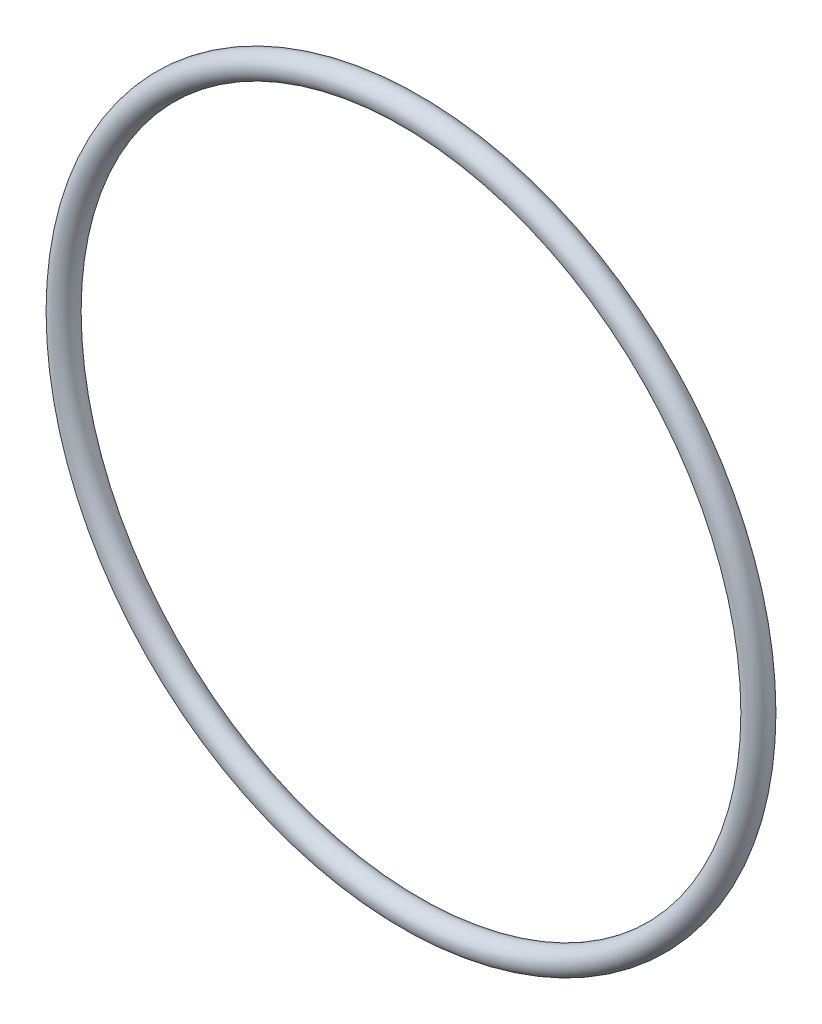
ISO-10303-21;
HEADER;
FILE_DESCRIPTION(('STEP AP214'),'2;1');
FILE_NAME('part.step','',(''),(''),'','','');
FILE_SCHEMA(('AUTOMOTIVE_DESIGN { 1 0 10303 214 1 1 1 1 }'));
ENDSEC;
DATA;
#1=APPLICATION_CONTEXT('core data for automotive mechanical design processes');
#2=APPLICATION_PROTOCOL_DEFINITION('international standard','automotive_design',2000,#1);
#3=PRODUCT_CONTEXT('',#1,'mechanical');
#4=PRODUCT('Part','Part','',(#3));
#5=PRODUCT_RELATED_PRODUCT_CATEGORY('part','',(#4));
#6=PRODUCT_DEFINITION_FORMATION('','',#4);
#7=PRODUCT_DEFINITION_CONTEXT('part definition',#1,'design');
#8=PRODUCT_DEFINITION('design','',#6,#7);
#9=PRODUCT_DEFINITION_SHAPE('','',#8);
#10=(LENGTH_UNIT() NAMED_UNIT(*) SI_UNIT(.MILLI.,.METRE.));
#11=(NAMED_UNIT(*) PLANE_ANGLE_UNIT() SI_UNIT($,.RADIAN.));
#12=(NAMED_UNIT(*) SI_UNIT($,.STERADIAN.) SOLID_ANGLE_UNIT());
#13=UNCERTAINTY_MEASURE_WITH_UNIT(LENGTH_MEASURE(1.E-05),#10,'distance_accuracy_value','');
#14=(GEOMETRIC_REPRESENTATION_CONTEXT(3) GLOBAL_UNCERTAINTY_ASSIGNED_CONTEXT((#13)) GLOBAL_UNIT_ASSIGNED_CONTEXT((#10,
#11,#12)) REPRESENTATION_CONTEXT('',''));
#15=CARTESIAN_POINT('',(0.,0.,0.));
#16=DIRECTION('',(0.,0.,1.));
#17=DIRECTION('',(1.,0.,0.));
#18=AXIS2_PLACEMENT_3D('',#15,#16,#17);
#19=CARTESIAN_POINT('',(0.,0.,0.7));
#20=DIRECTION('',(0.,0.,-1.));
#21=DIRECTION('',(-1.,0.,0.));
#22=AXIS2_PLACEMENT_3D('',#19,#20,#21);
#23=TOROIDAL_SURFACE('',#22,1.4,0.0499999999999999);
#24=CARTESIAN_POINT('',(-1.45,0.,0.7));
#25=VERTEX_POINT('',#24);
#26=VERTEX_LOOP('',#25);
#27=FACE_BOUND('',#26,.T.);
#28=ADVANCED_FACE('F13',(#27),#23,.T.);
#29=CLOSED_SHELL('',(#28));
#30=MANIFOLD_SOLID_BREP('B1',#29);
#31=ADVANCED_BREP_SHAPE_REPRESENTATION('',(#18,#30),#14);
#32=SHAPE_DEFINITION_REPRESENTATION(#9,#31);
ENDSEC;
END-ISO-10303-21;
